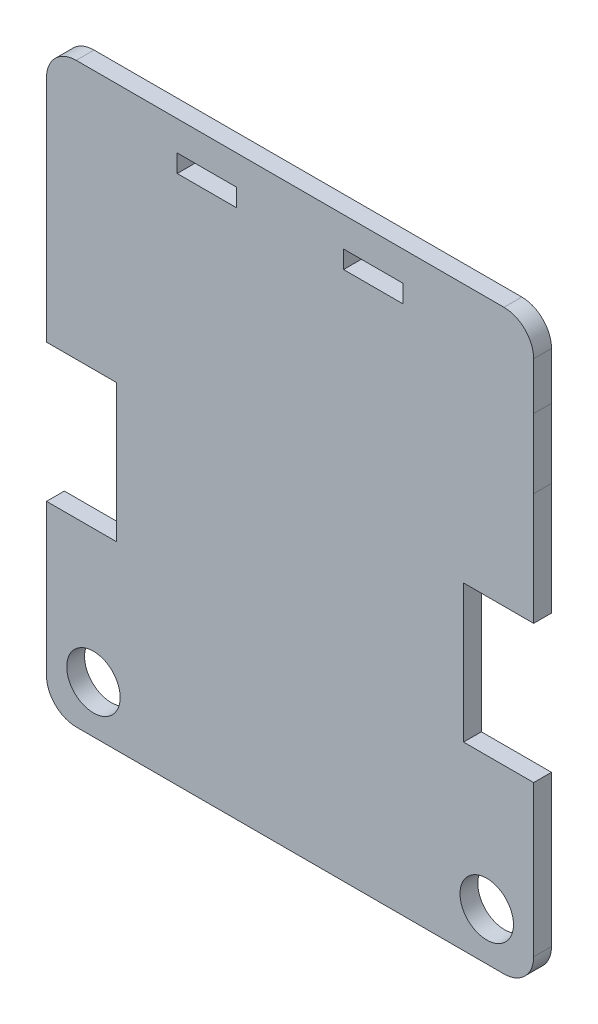
ISO-10303-21;
HEADER;
FILE_DESCRIPTION(('STEP AP214'),'2;1');
FILE_NAME('part.step','',(''),(''),'','','');
FILE_SCHEMA(('AUTOMOTIVE_DESIGN { 1 0 10303 214 1 1 1 1 }'));
ENDSEC;
DATA;
#1=APPLICATION_CONTEXT('core data for automotive mechanical design processes');
#2=APPLICATION_PROTOCOL_DEFINITION('international standard','automotive_design',2000,#1);
#3=PRODUCT_CONTEXT('',#1,'mechanical');
#4=PRODUCT('Part','Part','',(#3));
#5=PRODUCT_RELATED_PRODUCT_CATEGORY('part','',(#4));
#6=PRODUCT_DEFINITION_FORMATION('','',#4);
#7=PRODUCT_DEFINITION_CONTEXT('part definition',#1,'design');
#8=PRODUCT_DEFINITION('design','',#6,#7);
#9=PRODUCT_DEFINITION_SHAPE('','',#8);
#10=(LENGTH_UNIT() NAMED_UNIT(*) SI_UNIT(.MILLI.,.METRE.));
#11=(NAMED_UNIT(*) PLANE_ANGLE_UNIT() SI_UNIT($,.RADIAN.));
#12=(NAMED_UNIT(*) SI_UNIT($,.STERADIAN.) SOLID_ANGLE_UNIT());
#13=UNCERTAINTY_MEASURE_WITH_UNIT(LENGTH_MEASURE(1.E-05),#10,'distance_accuracy_value','');
#14=(GEOMETRIC_REPRESENTATION_CONTEXT(3) GLOBAL_UNCERTAINTY_ASSIGNED_CONTEXT((#13)) GLOBAL_UNIT_ASSIGNED_CONTEXT((#10,
#11,#12)) REPRESENTATION_CONTEXT('',''));
#15=CARTESIAN_POINT('',(0.,0.,0.));
#16=DIRECTION('',(0.,0.,1.));
#17=DIRECTION('',(1.,0.,0.));
#18=AXIS2_PLACEMENT_3D('',#15,#16,#17);
#19=CARTESIAN_POINT('',(72.203528383449,48.6883427131033,3.));
#20=DIRECTION('',(0.,0.,1.));
#21=DIRECTION('',(1.,0.,0.));
#22=AXIS2_PLACEMENT_3D('',#19,#20,#21);
#23=PLANE('',#22);
#24=CARTESIAN_POINT('',(69.303528383449,-35.4954464401244,3.));
#25=DIRECTION('',(0.,0.,1.));
#26=DIRECTION('',(1.,0.,0.));
#27=AXIS2_PLACEMENT_3D('',#24,#25,#26);
#28=CIRCLE('',#27,4.5);
#29=CARTESIAN_POINT('',(73.8035283834491,-35.4954464401244,3.));
#30=VERTEX_POINT('',#29);
#31=EDGE_CURVE('E278',#30,#30,#28,.T.);
#32=ORIENTED_EDGE('',*,*,#31,.F.);
#33=EDGE_LOOP('',(#32));
#34=FACE_BOUND('',#33,.T.);
#35=CARTESIAN_POINT('',(72.203528383449,48.6883427131033,3.));
#36=DIRECTION('',(0.,0.,1.));
#37=DIRECTION('',(1.,0.,0.));
#38=AXIS2_PLACEMENT_3D('',#35,#36,#37);
#39=CIRCLE('',#38,5.);
#40=CARTESIAN_POINT('',(77.203528383449,48.6883427131033,3.));
#41=VERTEX_POINT('',#40);
#42=CARTESIAN_POINT('',(72.203528383449,53.6883427131033,3.));
#43=VERTEX_POINT('',#42);
#44=EDGE_CURVE('E284',#41,#43,#39,.T.);
#45=ORIENTED_EDGE('',*,*,#44,.T.);
#46=DIRECTION('',(-1.,0.,0.));
#47=VECTOR('',#46,1.);
#48=CARTESIAN_POINT('',(62.6864958786092,53.6883427131033,3.));
#49=LINE('',#48,#47);
#50=CARTESIAN_POINT('',(0.206594728342232,53.6883427131033,3.));
#51=VERTEX_POINT('',#50);
#52=EDGE_CURVE('E287',#43,#51,#49,.T.);
#53=ORIENTED_EDGE('',*,*,#52,.T.);
#54=CARTESIAN_POINT('',(0.206594728342236,48.6883427131033,3.));
#55=DIRECTION('',(0.,0.,1.));
#56=DIRECTION('',(1.,0.,0.));
#57=AXIS2_PLACEMENT_3D('',#54,#55,#56);
#58=CIRCLE('',#57,5.);
#59=CARTESIAN_POINT('',(-4.79340527165777,48.6883427131033,3.));
#60=VERTEX_POINT('',#59);
#61=EDGE_CURVE('E290',#51,#60,#58,.T.);
#62=ORIENTED_EDGE('',*,*,#61,.T.);
#63=DIRECTION('',(0.,-1.,0.));
#64=VECTOR('',#63,1.);
#65=CARTESIAN_POINT('',(-4.79340527165777,48.6883427131033,3.));
#66=LINE('',#65,#64);
#67=CARTESIAN_POINT('',(-4.79340527165777,10.1045535598754,3.));
#68=VERTEX_POINT('',#67);
#69=EDGE_CURVE('E292',#60,#68,#66,.T.);
#70=ORIENTED_EDGE('',*,*,#69,.T.);
#71=DIRECTION('',(1.,0.,0.));
#72=VECTOR('',#71,1.);
#73=CARTESIAN_POINT('',(7.00659472834224,10.1045535598754,3.));
#74=LINE('',#73,#72);
#75=CARTESIAN_POINT('',(7.00659472834224,10.1045535598754,3.));
#76=VERTEX_POINT('',#75);
#77=EDGE_CURVE('E294',#68,#76,#74,.T.);
#78=ORIENTED_EDGE('',*,*,#77,.T.);
#79=DIRECTION('',(0.,-1.,0.));
#80=VECTOR('',#79,1.);
#81=CARTESIAN_POINT('',(7.00659472834224,-13.0954464401246,3.));
#82=LINE('',#81,#80);
#83=CARTESIAN_POINT('',(7.00659472834224,-13.0954464401246,3.));
#84=VERTEX_POINT('',#83);
#85=EDGE_CURVE('E296',#76,#84,#82,.T.);
#86=ORIENTED_EDGE('',*,*,#85,.T.);
#87=DIRECTION('',(-1.,0.,0.));
#88=VECTOR('',#87,1.);
#89=CARTESIAN_POINT('',(-4.79340527165777,-13.0954464401245,3.));
#90=LINE('',#89,#88);
#91=CARTESIAN_POINT('',(-4.79340527165777,-13.0954464401245,3.));
#92=VERTEX_POINT('',#91);
#93=EDGE_CURVE('E298',#84,#92,#90,.T.);
#94=ORIENTED_EDGE('',*,*,#93,.T.);
#95=DIRECTION('',(0.,-1.,0.));
#96=VECTOR('',#95,1.);
#97=CARTESIAN_POINT('',(-4.79340527165777,-13.0954464401245,3.));
#98=LINE('',#97,#96);
#99=CARTESIAN_POINT('',(-4.79340527165777,-38.4954460525135,3.));
#100=VERTEX_POINT('',#99);
#101=EDGE_CURVE('E300',#92,#100,#98,.T.);
#102=ORIENTED_EDGE('',*,*,#101,.T.);
#103=CARTESIAN_POINT('',(0.206594728342231,-38.4954460525135,3.));
#104=DIRECTION('',(0.,0.,1.));
#105=DIRECTION('',(1.,0.,0.));
#106=AXIS2_PLACEMENT_3D('',#103,#104,#105);
#107=CIRCLE('',#106,5.);
#108=CARTESIAN_POINT('',(0.206594728342232,-43.4954460525135,3.));
#109=VERTEX_POINT('',#108);
#110=EDGE_CURVE('E302',#100,#109,#107,.T.);
#111=ORIENTED_EDGE('',*,*,#110,.T.);
#112=DIRECTION('',(1.,0.,0.));
#113=VECTOR('',#112,1.);
#114=CARTESIAN_POINT('',(0.206594728342232,-43.4954460525135,3.));
#115=LINE('',#114,#113);
#116=CARTESIAN_POINT('',(72.203528383449,-43.4954460525135,3.));
#117=VERTEX_POINT('',#116);
#118=EDGE_CURVE('E304',#109,#117,#115,.T.);
#119=ORIENTED_EDGE('',*,*,#118,.T.);
#120=CARTESIAN_POINT('',(72.2035283834491,-38.4954460525136,3.));
#121=DIRECTION('',(0.,0.,1.));
#122=DIRECTION('',(1.,0.,0.));
#123=AXIS2_PLACEMENT_3D('',#120,#121,#122);
#124=CIRCLE('',#123,4.99999999999994);
#125=CARTESIAN_POINT('',(77.203528383449,-38.4954464401244,3.));
#126=VERTEX_POINT('',#125);
#127=EDGE_CURVE('E306',#117,#126,#124,.T.);
#128=ORIENTED_EDGE('',*,*,#127,.T.);
#129=DIRECTION('',(0.,1.,0.));
#130=VECTOR('',#129,1.);
#131=CARTESIAN_POINT('',(77.203528383449,-38.4954464401244,3.));
#132=LINE('',#131,#130);
#133=CARTESIAN_POINT('',(77.203528383449,-13.0954464401246,3.));
#134=VERTEX_POINT('',#133);
#135=EDGE_CURVE('E308',#126,#134,#132,.T.);
#136=ORIENTED_EDGE('',*,*,#135,.T.);
#137=DIRECTION('',(-1.,0.,0.));
#138=VECTOR('',#137,1.);
#139=CARTESIAN_POINT('',(65.403528383449,-13.0954464401246,3.));
#140=LINE('',#139,#138);
#141=CARTESIAN_POINT('',(65.403528383449,-13.0954464401246,3.));
#142=VERTEX_POINT('',#141);
#143=EDGE_CURVE('E310',#134,#142,#140,.T.);
#144=ORIENTED_EDGE('',*,*,#143,.T.);
#145=DIRECTION('',(0.,1.,0.));
#146=VECTOR('',#145,1.);
#147=CARTESIAN_POINT('',(65.403528383449,10.1045535598754,3.));
#148=LINE('',#147,#146);
#149=CARTESIAN_POINT('',(65.403528383449,10.1045535598754,3.));
#150=VERTEX_POINT('',#149);
#151=EDGE_CURVE('E312',#142,#150,#148,.T.);
#152=ORIENTED_EDGE('',*,*,#151,.T.);
#153=DIRECTION('',(1.,0.,0.));
#154=VECTOR('',#153,1.);
#155=CARTESIAN_POINT('',(77.203528383449,10.1045535598754,3.));
#156=LINE('',#155,#154);
#157=CARTESIAN_POINT('',(77.203528383449,10.1045535598754,3.));
#158=VERTEX_POINT('',#157);
#159=EDGE_CURVE('E314',#150,#158,#156,.T.);
#160=ORIENTED_EDGE('',*,*,#159,.T.);
#161=DIRECTION('',(1.78942856260876E-12,1.,0.));
#162=VECTOR('',#161,1.);
#163=CARTESIAN_POINT('',(77.2035283834659,19.5506671981172,3.));
#164=LINE('',#163,#162);
#165=CARTESIAN_POINT('',(77.2035283834688,29.0099072291552,3.));
#166=VERTEX_POINT('',#165);
#167=EDGE_CURVE('E316',#158,#166,#164,.T.);
#168=ORIENTED_EDGE('',*,*,#167,.T.);
#169=DIRECTION('',(-0.000262564691243495,0.999999965529891,0.));
#170=VECTOR('',#169,1.);
#171=CARTESIAN_POINT('',(77.2035283834688,29.0099072291552,3.));
#172=LINE('',#171,#170);
#173=CARTESIAN_POINT('',(77.2004620385561,40.6883427131033,3.));
#174=VERTEX_POINT('',#173);
#175=EDGE_CURVE('E318',#166,#174,#172,.T.);
#176=ORIENTED_EDGE('',*,*,#175,.T.);
#177=DIRECTION('',(0.00038329308345552,0.999999926543203,0.));
#178=VECTOR('',#177,1.);
#179=CARTESIAN_POINT('',(77.2004620385561,40.6883427131033,3.));
#180=LINE('',#179,#178);
#181=EDGE_CURVE('E320',#174,#41,#180,.T.);
#182=ORIENTED_EDGE('',*,*,#181,.T.);
#183=EDGE_LOOP('',(#45,#53,#62,#70,#78,#86,#94,#102,#111,#119,#128,#136,#144,#152,#160,#168,
#176,#182));
#184=FACE_BOUND('',#183,.T.);
#185=CARTESIAN_POINT('',(3.10352838345015,-35.4954464401244,3.));
#186=DIRECTION('',(0.,0.,1.));
#187=DIRECTION('',(1.,0.,0.));
#188=AXIS2_PLACEMENT_3D('',#185,#186,#187);
#189=CIRCLE('',#188,4.5);
#190=CARTESIAN_POINT('',(7.60352838345015,-35.4954464401244,3.));
#191=VERTEX_POINT('',#190);
#192=EDGE_CURVE('E272',#191,#191,#189,.T.);
#193=ORIENTED_EDGE('',*,*,#192,.F.);
#194=EDGE_LOOP('',(#193));
#195=FACE_BOUND('',#194,.T.);
#196=DIRECTION('',(0.,-1.,0.));
#197=VECTOR('',#196,1.);
#198=CARTESIAN_POINT('',(17.2035283834491,48.6883427131033,3.));
#199=LINE('',#198,#197);
#200=CARTESIAN_POINT('',(17.2035283834491,48.6883427131033,3.));
#201=VERTEX_POINT('',#200);
#202=CARTESIAN_POINT('',(17.2035283834491,45.6883427131033,3.));
#203=VERTEX_POINT('',#202);
#204=EDGE_CURVE('E243',#201,#203,#199,.T.);
#205=ORIENTED_EDGE('',*,*,#204,.F.);
#206=DIRECTION('',(-1.,0.,0.));
#207=VECTOR('',#206,1.);
#208=CARTESIAN_POINT('',(27.2035283834491,48.6883427131033,3.));
#209=LINE('',#208,#207);
#210=CARTESIAN_POINT('',(27.2035283834491,48.6883427131033,3.));
#211=VERTEX_POINT('',#210);
#212=EDGE_CURVE('E241',#211,#201,#209,.T.);
#213=ORIENTED_EDGE('',*,*,#212,.F.);
#214=DIRECTION('',(0.,1.,0.));
#215=VECTOR('',#214,1.);
#216=CARTESIAN_POINT('',(27.2035283834491,45.6883427131033,3.));
#217=LINE('',#216,#215);
#218=CARTESIAN_POINT('',(27.2035283834491,45.6883427131033,3.));
#219=VERTEX_POINT('',#218);
#220=EDGE_CURVE('E249',#219,#211,#217,.T.);
#221=ORIENTED_EDGE('',*,*,#220,.F.);
#222=DIRECTION('',(1.,0.,0.));
#223=VECTOR('',#222,1.);
#224=CARTESIAN_POINT('',(17.2035283834491,45.6883427131033,3.));
#225=LINE('',#224,#223);
#226=EDGE_CURVE('E246',#203,#219,#225,.T.);
#227=ORIENTED_EDGE('',*,*,#226,.F.);
#228=EDGE_LOOP('',(#205,#213,#221,#227));
#229=FACE_BOUND('',#228,.T.);
#230=DIRECTION('',(-1.,0.,0.));
#231=VECTOR('',#230,1.);
#232=CARTESIAN_POINT('',(55.2035283834492,48.6883427131033,3.));
#233=LINE('',#232,#231);
#234=CARTESIAN_POINT('',(55.2035283834492,48.6883427131033,3.));
#235=VERTEX_POINT('',#234);
#236=CARTESIAN_POINT('',(45.2035283834492,48.6883427131033,3.));
#237=VERTEX_POINT('',#236);
#238=EDGE_CURVE('E213',#235,#237,#233,.T.);
#239=ORIENTED_EDGE('',*,*,#238,.F.);
#240=DIRECTION('',(0.,1.,0.));
#241=VECTOR('',#240,1.);
#242=CARTESIAN_POINT('',(55.2035283834492,45.6883427131033,3.));
#243=LINE('',#242,#241);
#244=CARTESIAN_POINT('',(55.2035283834492,45.6883427131033,3.));
#245=VERTEX_POINT('',#244);
#246=EDGE_CURVE('E205',#245,#235,#243,.T.);
#247=ORIENTED_EDGE('',*,*,#246,.F.);
#248=DIRECTION('',(1.,0.,0.));
#249=VECTOR('',#248,1.);
#250=CARTESIAN_POINT('',(45.2035283834492,45.6883427131033,3.));
#251=LINE('',#250,#249);
#252=CARTESIAN_POINT('',(45.2035283834492,45.6883427131033,3.));
#253=VERTEX_POINT('',#252);
#254=EDGE_CURVE('E227',#253,#245,#251,.T.);
#255=ORIENTED_EDGE('',*,*,#254,.F.);
#256=DIRECTION('',(0.,-1.,0.));
#257=VECTOR('',#256,1.);
#258=CARTESIAN_POINT('',(45.2035283834492,48.6883427131033,3.));
#259=LINE('',#258,#257);
#260=EDGE_CURVE('E225',#237,#253,#259,.T.);
#261=ORIENTED_EDGE('',*,*,#260,.F.);
#262=EDGE_LOOP('',(#239,#247,#255,#261));
#263=FACE_BOUND('',#262,.T.);
#264=ADVANCED_FACE('F32',(#34,#184,#195,#229,#263),#23,.T.);
#265=CARTESIAN_POINT('',(72.203528383449,48.6883427131033,0.));
#266=DIRECTION('',(0.,0.,1.));
#267=DIRECTION('',(1.,0.,0.));
#268=AXIS2_PLACEMENT_3D('',#265,#266,#267);
#269=PLANE('',#268);
#270=DIRECTION('',(-1.,0.,0.));
#271=VECTOR('',#270,1.);
#272=CARTESIAN_POINT('',(27.2035283834491,48.6883427131033,0.));
#273=LINE('',#272,#271);
#274=CARTESIAN_POINT('',(27.2035283834491,48.6883427131033,0.));
#275=VERTEX_POINT('',#274);
#276=CARTESIAN_POINT('',(17.2035283834491,48.6883427131033,0.));
#277=VERTEX_POINT('',#276);
#278=EDGE_CURVE('E221',#275,#277,#273,.T.);
#279=ORIENTED_EDGE('',*,*,#278,.T.);
#280=DIRECTION('',(0.,-1.,0.));
#281=VECTOR('',#280,1.);
#282=CARTESIAN_POINT('',(17.2035283834491,48.6883427131033,0.));
#283=LINE('',#282,#281);
#284=CARTESIAN_POINT('',(17.2035283834491,45.6883427131033,0.));
#285=VERTEX_POINT('',#284);
#286=EDGE_CURVE('E254',#277,#285,#283,.T.);
#287=ORIENTED_EDGE('',*,*,#286,.T.);
#288=DIRECTION('',(1.,0.,0.));
#289=VECTOR('',#288,1.);
#290=CARTESIAN_POINT('',(17.2035283834491,45.6883427131033,0.));
#291=LINE('',#290,#289);
#292=CARTESIAN_POINT('',(27.2035283834491,45.6883427131033,0.));
#293=VERTEX_POINT('',#292);
#294=EDGE_CURVE('E257',#285,#293,#291,.T.);
#295=ORIENTED_EDGE('',*,*,#294,.T.);
#296=DIRECTION('',(0.,1.,0.));
#297=VECTOR('',#296,1.);
#298=CARTESIAN_POINT('',(27.2035283834491,45.6883427131033,0.));
#299=LINE('',#298,#297);
#300=EDGE_CURVE('E244',#293,#275,#299,.T.);
#301=ORIENTED_EDGE('',*,*,#300,.T.);
#302=EDGE_LOOP('',(#279,#287,#295,#301));
#303=FACE_BOUND('',#302,.T.);
#304=CARTESIAN_POINT('',(72.203528383449,48.6883427131033,0.));
#305=DIRECTION('',(0.,0.,1.));
#306=DIRECTION('',(1.,0.,0.));
#307=AXIS2_PLACEMENT_3D('',#304,#305,#306);
#308=CIRCLE('',#307,5.);
#309=CARTESIAN_POINT('',(77.203528383449,48.6883427131033,0.));
#310=VERTEX_POINT('',#309);
#311=CARTESIAN_POINT('',(72.203528383449,53.6883427131033,0.));
#312=VERTEX_POINT('',#311);
#313=EDGE_CURVE('E281',#310,#312,#308,.T.);
#314=ORIENTED_EDGE('',*,*,#313,.F.);
#315=DIRECTION('',(0.00038329308345552,0.999999926543203,0.));
#316=VECTOR('',#315,1.);
#317=CARTESIAN_POINT('',(77.2004620385561,40.6883427131033,0.));
#318=LINE('',#317,#316);
#319=CARTESIAN_POINT('',(77.2004620385561,40.6883427131033,0.));
#320=VERTEX_POINT('',#319);
#321=EDGE_CURVE('E288',#320,#310,#318,.T.);
#322=ORIENTED_EDGE('',*,*,#321,.F.);
#323=DIRECTION('',(-0.000262564691243495,0.999999965529891,0.));
#324=VECTOR('',#323,1.);
#325=CARTESIAN_POINT('',(77.2035283834688,29.0099072291552,0.));
#326=LINE('',#325,#324);
#327=CARTESIAN_POINT('',(77.2035283834688,29.0099072291552,0.));
#328=VERTEX_POINT('',#327);
#329=EDGE_CURVE('E358',#328,#320,#326,.T.);
#330=ORIENTED_EDGE('',*,*,#329,.F.);
#331=DIRECTION('',(3.12495379477131E-13,1.,0.));
#332=VECTOR('',#331,1.);
#333=CARTESIAN_POINT('',(77.2035283834688,29.0099072291552,0.));
#334=LINE('',#333,#332);
#335=CARTESIAN_POINT('',(77.203528383449,10.1045535598754,0.));
#336=VERTEX_POINT('',#335);
#337=EDGE_CURVE('E356',#336,#328,#334,.T.);
#338=ORIENTED_EDGE('',*,*,#337,.F.);
#339=DIRECTION('',(1.,0.,0.));
#340=VECTOR('',#339,1.);
#341=CARTESIAN_POINT('',(77.203528383449,10.1045535598754,0.));
#342=LINE('',#341,#340);
#343=CARTESIAN_POINT('',(65.403528383449,10.1045535598754,0.));
#344=VERTEX_POINT('',#343);
#345=EDGE_CURVE('E353',#344,#336,#342,.T.);
#346=ORIENTED_EDGE('',*,*,#345,.F.);
#347=DIRECTION('',(0.,1.,0.));
#348=VECTOR('',#347,1.);
#349=CARTESIAN_POINT('',(65.403528383449,10.1045535598754,0.));
#350=LINE('',#349,#348);
#351=CARTESIAN_POINT('',(65.403528383449,-13.0954464401246,0.));
#352=VERTEX_POINT('',#351);
#353=EDGE_CURVE('E351',#352,#344,#350,.T.);
#354=ORIENTED_EDGE('',*,*,#353,.F.);
#355=DIRECTION('',(-1.,0.,0.));
#356=VECTOR('',#355,1.);
#357=CARTESIAN_POINT('',(65.403528383449,-13.0954464401246,0.));
#358=LINE('',#357,#356);
#359=CARTESIAN_POINT('',(77.203528383449,-13.0954464401246,0.));
#360=VERTEX_POINT('',#359);
#361=EDGE_CURVE('E349',#360,#352,#358,.T.);
#362=ORIENTED_EDGE('',*,*,#361,.F.);
#363=DIRECTION('',(0.,1.,0.));
#364=VECTOR('',#363,1.);
#365=CARTESIAN_POINT('',(77.203528383449,-33.1904365899432,0.));
#366=LINE('',#365,#364);
#367=CARTESIAN_POINT('',(77.203528383449,-38.4954464401244,0.));
#368=VERTEX_POINT('',#367);
#369=EDGE_CURVE('E347',#368,#360,#366,.T.);
#370=ORIENTED_EDGE('',*,*,#369,.F.);
#371=CARTESIAN_POINT('',(72.2035283834491,-38.4954460525136,0.));
#372=DIRECTION('',(0.,0.,1.));
#373=DIRECTION('',(1.,0.,0.));
#374=AXIS2_PLACEMENT_3D('',#371,#372,#373);
#375=CIRCLE('',#374,4.99999999999994);
#376=CARTESIAN_POINT('',(72.203528383449,-43.4954460525135,0.));
#377=VERTEX_POINT('',#376);
#378=EDGE_CURVE('E344',#377,#368,#375,.T.);
#379=ORIENTED_EDGE('',*,*,#378,.F.);
#380=DIRECTION('',(1.,0.,0.));
#381=VECTOR('',#380,1.);
#382=CARTESIAN_POINT('',(0.206594728342232,-43.4954460525135,0.));
#383=LINE('',#382,#381);
#384=CARTESIAN_POINT('',(0.206594728342232,-43.4954460525135,0.));
#385=VERTEX_POINT('',#384);
#386=EDGE_CURVE('E342',#385,#377,#383,.T.);
#387=ORIENTED_EDGE('',*,*,#386,.F.);
#388=CARTESIAN_POINT('',(0.206594728342231,-38.4954460525135,0.));
#389=DIRECTION('',(0.,0.,1.));
#390=DIRECTION('',(1.,0.,0.));
#391=AXIS2_PLACEMENT_3D('',#388,#389,#390);
#392=CIRCLE('',#391,5.);
#393=CARTESIAN_POINT('',(-4.79340527165777,-38.4954460525135,0.));
#394=VERTEX_POINT('',#393);
#395=EDGE_CURVE('E340',#394,#385,#392,.T.);
#396=ORIENTED_EDGE('',*,*,#395,.F.);
#397=DIRECTION('',(0.,-1.,0.));
#398=VECTOR('',#397,1.);
#399=CARTESIAN_POINT('',(-4.79340527165777,-13.0954464401245,0.));
#400=LINE('',#399,#398);
#401=CARTESIAN_POINT('',(-4.79340527165777,-13.0954464401245,0.));
#402=VERTEX_POINT('',#401);
#403=EDGE_CURVE('E338',#402,#394,#400,.T.);
#404=ORIENTED_EDGE('',*,*,#403,.F.);
#405=DIRECTION('',(-1.,0.,0.));
#406=VECTOR('',#405,1.);
#407=CARTESIAN_POINT('',(-4.79340527165777,-13.0954464401245,0.));
#408=LINE('',#407,#406);
#409=CARTESIAN_POINT('',(7.00659472834224,-13.0954464401246,0.));
#410=VERTEX_POINT('',#409);
#411=EDGE_CURVE('E336',#410,#402,#408,.T.);
#412=ORIENTED_EDGE('',*,*,#411,.F.);
#413=DIRECTION('',(0.,-1.,0.));
#414=VECTOR('',#413,1.);
#415=CARTESIAN_POINT('',(7.00659472834224,-13.0954464401246,0.));
#416=LINE('',#415,#414);
#417=CARTESIAN_POINT('',(7.00659472834224,10.1045535598754,0.));
#418=VERTEX_POINT('',#417);
#419=EDGE_CURVE('E334',#418,#410,#416,.T.);
#420=ORIENTED_EDGE('',*,*,#419,.F.);
#421=DIRECTION('',(1.,0.,0.));
#422=VECTOR('',#421,1.);
#423=CARTESIAN_POINT('',(7.00659472834224,10.1045535598754,0.));
#424=LINE('',#423,#422);
#425=CARTESIAN_POINT('',(-4.79340527165777,10.1045535598754,0.));
#426=VERTEX_POINT('',#425);
#427=EDGE_CURVE('E332',#426,#418,#424,.T.);
#428=ORIENTED_EDGE('',*,*,#427,.F.);
#429=DIRECTION('',(0.,-1.,0.));
#430=VECTOR('',#429,1.);
#431=CARTESIAN_POINT('',(-4.79340527165777,40.6883427131033,0.));
#432=LINE('',#431,#430);
#433=CARTESIAN_POINT('',(-4.79340527165777,48.6883427131033,0.));
#434=VERTEX_POINT('',#433);
#435=EDGE_CURVE('E330',#434,#426,#432,.T.);
#436=ORIENTED_EDGE('',*,*,#435,.F.);
#437=CARTESIAN_POINT('',(0.206594728342236,48.6883427131033,0.));
#438=DIRECTION('',(0.,0.,1.));
#439=DIRECTION('',(1.,0.,0.));
#440=AXIS2_PLACEMENT_3D('',#437,#438,#439);
#441=CIRCLE('',#440,5.);
#442=CARTESIAN_POINT('',(0.206594728342232,53.6883427131033,0.));
#443=VERTEX_POINT('',#442);
#444=EDGE_CURVE('E327',#443,#434,#441,.T.);
#445=ORIENTED_EDGE('',*,*,#444,.F.);
#446=DIRECTION('',(-1.,0.,0.));
#447=VECTOR('',#446,1.);
#448=CARTESIAN_POINT('',(6.68151859722884,53.6883427131033,0.));
#449=LINE('',#448,#447);
#450=EDGE_CURVE('E325',#312,#443,#449,.T.);
#451=ORIENTED_EDGE('',*,*,#450,.F.);
#452=EDGE_LOOP('',(#314,#322,#330,#338,#346,#354,#362,#370,#379,#387,#396,#404,#412,#420,#428,
#436,#445,#451));
#453=FACE_BOUND('',#452,.T.);
#454=CARTESIAN_POINT('',(69.303528383449,-35.4954464401244,0.));
#455=DIRECTION('',(0.,0.,1.));
#456=DIRECTION('',(1.,0.,0.));
#457=AXIS2_PLACEMENT_3D('',#454,#455,#456);
#458=CIRCLE('',#457,4.5);
#459=CARTESIAN_POINT('',(73.8035283834491,-35.4954464401244,0.));
#460=VERTEX_POINT('',#459);
#461=EDGE_CURVE('E275',#460,#460,#458,.T.);
#462=ORIENTED_EDGE('',*,*,#461,.T.);
#463=EDGE_LOOP('',(#462));
#464=FACE_BOUND('',#463,.T.);
#465=CARTESIAN_POINT('',(3.10352838345015,-35.4954464401244,0.));
#466=DIRECTION('',(0.,0.,1.));
#467=DIRECTION('',(1.,0.,0.));
#468=AXIS2_PLACEMENT_3D('',#465,#466,#467);
#469=CIRCLE('',#468,4.5);
#470=CARTESIAN_POINT('',(7.60352838345015,-35.4954464401244,0.));
#471=VERTEX_POINT('',#470);
#472=EDGE_CURVE('E271',#471,#471,#469,.T.);
#473=ORIENTED_EDGE('',*,*,#472,.T.);
#474=EDGE_LOOP('',(#473));
#475=FACE_BOUND('',#474,.T.);
#476=DIRECTION('',(0.,1.,0.));
#477=VECTOR('',#476,1.);
#478=CARTESIAN_POINT('',(55.2035283834492,45.6883427131033,0.));
#479=LINE('',#478,#477);
#480=CARTESIAN_POINT('',(55.2035283834492,45.6883427131033,0.));
#481=VERTEX_POINT('',#480);
#482=CARTESIAN_POINT('',(55.2035283834492,48.6883427131033,0.));
#483=VERTEX_POINT('',#482);
#484=EDGE_CURVE('E55',#481,#483,#479,.T.);
#485=ORIENTED_EDGE('',*,*,#484,.T.);
#486=DIRECTION('',(-1.,0.,0.));
#487=VECTOR('',#486,1.);
#488=CARTESIAN_POINT('',(55.2035283834492,48.6883427131033,0.));
#489=LINE('',#488,#487);
#490=CARTESIAN_POINT('',(45.2035283834492,48.6883427131033,0.));
#491=VERTEX_POINT('',#490);
#492=EDGE_CURVE('E220',#483,#491,#489,.T.);
#493=ORIENTED_EDGE('',*,*,#492,.T.);
#494=DIRECTION('',(0.,-1.,0.));
#495=VECTOR('',#494,1.);
#496=CARTESIAN_POINT('',(45.2035283834492,48.6883427131033,0.));
#497=LINE('',#496,#495);
#498=CARTESIAN_POINT('',(45.2035283834492,45.6883427131033,0.));
#499=VERTEX_POINT('',#498);
#500=EDGE_CURVE('E233',#491,#499,#497,.T.);
#501=ORIENTED_EDGE('',*,*,#500,.T.);
#502=DIRECTION('',(1.,0.,0.));
#503=VECTOR('',#502,1.);
#504=CARTESIAN_POINT('',(45.2035283834492,45.6883427131033,0.));
#505=LINE('',#504,#503);
#506=EDGE_CURVE('E214',#499,#481,#505,.T.);
#507=ORIENTED_EDGE('',*,*,#506,.T.);
#508=EDGE_LOOP('',(#485,#493,#501,#507));
#509=FACE_BOUND('',#508,.T.);
#510=ADVANCED_FACE('F417',(#303,#453,#464,#475,#509),#269,.F.);
#511=CARTESIAN_POINT('',(72.203528383449,48.6883427131033,3.));
#512=DIRECTION('',(0.,0.,-1.));
#513=DIRECTION('',(-1.,0.,0.));
#514=AXIS2_PLACEMENT_3D('',#511,#512,#513);
#515=CYLINDRICAL_SURFACE('',#514,5.);
#516=ORIENTED_EDGE('',*,*,#313,.T.);
#517=DIRECTION('',(0.,0.,-1.));
#518=VECTOR('',#517,1.);
#519=CARTESIAN_POINT('',(72.203528383449,53.6883427131033,3.));
#520=LINE('',#519,#518);
#521=EDGE_CURVE('E11',#43,#312,#520,.T.);
#522=ORIENTED_EDGE('',*,*,#521,.F.);
#523=ORIENTED_EDGE('',*,*,#44,.F.);
#524=DIRECTION('',(0.,0.,-1.));
#525=VECTOR('',#524,1.);
#526=CARTESIAN_POINT('',(77.203528383449,48.6883427131033,3.));
#527=LINE('',#526,#525);
#528=EDGE_CURVE('E322',#41,#310,#527,.T.);
#529=ORIENTED_EDGE('',*,*,#528,.T.);
#530=EDGE_LOOP('',(#516,#522,#523,#529));
#531=FACE_BOUND('',#530,.T.);
#532=ADVANCED_FACE('F34',(#531),#515,.T.);
#533=CARTESIAN_POINT('',(6.68151859722884,53.6883427131033,3.));
#534=DIRECTION('',(0.,-1.,0.));
#535=DIRECTION('',(1.,0.,0.));
#536=AXIS2_PLACEMENT_3D('',#533,#534,#535);
#537=PLANE('',#536);
#538=ORIENTED_EDGE('',*,*,#450,.T.);
#539=DIRECTION('',(0.,0.,-1.));
#540=VECTOR('',#539,1.);
#541=CARTESIAN_POINT('',(0.206594728342232,53.6883427131033,3.));
#542=LINE('',#541,#540);
#543=EDGE_CURVE('E40',#51,#443,#542,.T.);
#544=ORIENTED_EDGE('',*,*,#543,.F.);
#545=ORIENTED_EDGE('',*,*,#52,.F.);
#546=ORIENTED_EDGE('',*,*,#521,.T.);
#547=EDGE_LOOP('',(#538,#544,#545,#546));
#548=FACE_BOUND('',#547,.T.);
#549=ADVANCED_FACE('F435',(#548),#537,.F.);
#550=CARTESIAN_POINT('',(0.206594728342236,48.6883427131033,3.));
#551=DIRECTION('',(0.,0.,-1.));
#552=DIRECTION('',(-1.,0.,0.));
#553=AXIS2_PLACEMENT_3D('',#550,#551,#552);
#554=CYLINDRICAL_SURFACE('',#553,5.);
#555=ORIENTED_EDGE('',*,*,#444,.T.);
#556=DIRECTION('',(0.,0.,-1.));
#557=VECTOR('',#556,1.);
#558=CARTESIAN_POINT('',(-4.79340527165777,48.6883427131033,3.));
#559=LINE('',#558,#557);
#560=EDGE_CURVE('E405',#60,#434,#559,.T.);
#561=ORIENTED_EDGE('',*,*,#560,.F.);
#562=ORIENTED_EDGE('',*,*,#61,.F.);
#563=ORIENTED_EDGE('',*,*,#543,.T.);
#564=EDGE_LOOP('',(#555,#561,#562,#563));
#565=FACE_BOUND('',#564,.T.);
#566=ADVANCED_FACE('F412',(#565),#554,.T.);
#567=CARTESIAN_POINT('',(-4.79340527165777,40.6883427131033,3.));
#568=DIRECTION('',(1.,0.,0.));
#569=DIRECTION('',(0.,0.,-1.));
#570=AXIS2_PLACEMENT_3D('',#567,#568,#569);
#571=PLANE('',#570);
#572=ORIENTED_EDGE('',*,*,#435,.T.);
#573=DIRECTION('',(0.,0.,-1.));
#574=VECTOR('',#573,1.);
#575=CARTESIAN_POINT('',(-4.79340527165777,10.1045535598754,3.));
#576=LINE('',#575,#574);
#577=EDGE_CURVE('E402',#68,#426,#576,.T.);
#578=ORIENTED_EDGE('',*,*,#577,.F.);
#579=ORIENTED_EDGE('',*,*,#69,.F.);
#580=ORIENTED_EDGE('',*,*,#560,.T.);
#581=EDGE_LOOP('',(#572,#578,#579,#580));
#582=FACE_BOUND('',#581,.T.);
#583=ADVANCED_FACE('F423',(#582),#571,.F.);
#584=CARTESIAN_POINT('',(7.00659472834224,10.1045535598754,3.));
#585=DIRECTION('',(0.,1.,0.));
#586=DIRECTION('',(0.,0.,1.));
#587=AXIS2_PLACEMENT_3D('',#584,#585,#586);
#588=PLANE('',#587);
#589=ORIENTED_EDGE('',*,*,#427,.T.);
#590=DIRECTION('',(0.,0.,-1.));
#591=VECTOR('',#590,1.);
#592=CARTESIAN_POINT('',(7.00659472834224,10.1045535598754,3.));
#593=LINE('',#592,#591);
#594=EDGE_CURVE('E399',#76,#418,#593,.T.);
#595=ORIENTED_EDGE('',*,*,#594,.F.);
#596=ORIENTED_EDGE('',*,*,#77,.F.);
#597=ORIENTED_EDGE('',*,*,#577,.T.);
#598=EDGE_LOOP('',(#589,#595,#596,#597));
#599=FACE_BOUND('',#598,.T.);
#600=ADVANCED_FACE('F427',(#599),#588,.F.);
#601=CARTESIAN_POINT('',(7.00659472834224,-13.0954464401246,3.));
#602=DIRECTION('',(1.,0.,0.));
#603=DIRECTION('',(0.,0.,-1.));
#604=AXIS2_PLACEMENT_3D('',#601,#602,#603);
#605=PLANE('',#604);
#606=ORIENTED_EDGE('',*,*,#419,.T.);
#607=DIRECTION('',(0.,0.,-1.));
#608=VECTOR('',#607,1.);
#609=CARTESIAN_POINT('',(7.00659472834224,-13.0954464401246,3.));
#610=LINE('',#609,#608);
#611=EDGE_CURVE('E396',#84,#410,#610,.T.);
#612=ORIENTED_EDGE('',*,*,#611,.F.);
#613=ORIENTED_EDGE('',*,*,#85,.F.);
#614=ORIENTED_EDGE('',*,*,#594,.T.);
#615=EDGE_LOOP('',(#606,#612,#613,#614));
#616=FACE_BOUND('',#615,.T.);
#617=ADVANCED_FACE('F496',(#616),#605,.F.);
#618=CARTESIAN_POINT('',(-4.79340527165777,-13.0954464401245,3.));
#619=DIRECTION('',(0.,-1.,0.));
#620=DIRECTION('',(1.,0.,0.));
#621=AXIS2_PLACEMENT_3D('',#618,#619,#620);
#622=PLANE('',#621);
#623=ORIENTED_EDGE('',*,*,#411,.T.);
#624=DIRECTION('',(0.,0.,-1.));
#625=VECTOR('',#624,1.);
#626=CARTESIAN_POINT('',(-4.79340527165777,-13.0954464401245,3.));
#627=LINE('',#626,#625);
#628=EDGE_CURVE('E393',#92,#402,#627,.T.);
#629=ORIENTED_EDGE('',*,*,#628,.F.);
#630=ORIENTED_EDGE('',*,*,#93,.F.);
#631=ORIENTED_EDGE('',*,*,#611,.T.);
#632=EDGE_LOOP('',(#623,#629,#630,#631));
#633=FACE_BOUND('',#632,.T.);
#634=ADVANCED_FACE('F493',(#633),#622,.F.);
#635=CARTESIAN_POINT('',(-4.79340527165777,-13.0954464401245,3.));
#636=DIRECTION('',(1.,0.,0.));
#637=DIRECTION('',(0.,0.,-1.));
#638=AXIS2_PLACEMENT_3D('',#635,#636,#637);
#639=PLANE('',#638);
#640=ORIENTED_EDGE('',*,*,#403,.T.);
#641=DIRECTION('',(0.,0.,-1.));
#642=VECTOR('',#641,1.);
#643=CARTESIAN_POINT('',(-4.79340527165777,-38.4954460525135,3.));
#644=LINE('',#643,#642);
#645=EDGE_CURVE('E390',#100,#394,#644,.T.);
#646=ORIENTED_EDGE('',*,*,#645,.F.);
#647=ORIENTED_EDGE('',*,*,#101,.F.);
#648=ORIENTED_EDGE('',*,*,#628,.T.);
#649=EDGE_LOOP('',(#640,#646,#647,#648));
#650=FACE_BOUND('',#649,.T.);
#651=ADVANCED_FACE('F489',(#650),#639,.F.);
#652=CARTESIAN_POINT('',(0.206594728342231,-38.4954460525135,3.));
#653=DIRECTION('',(0.,0.,-1.));
#654=DIRECTION('',(-1.,0.,0.));
#655=AXIS2_PLACEMENT_3D('',#652,#653,#654);
#656=CYLINDRICAL_SURFACE('',#655,5.);
#657=ORIENTED_EDGE('',*,*,#395,.T.);
#658=DIRECTION('',(0.,0.,-1.));
#659=VECTOR('',#658,1.);
#660=CARTESIAN_POINT('',(0.206594728342232,-43.4954460525135,3.));
#661=LINE('',#660,#659);
#662=EDGE_CURVE('E387',#109,#385,#661,.T.);
#663=ORIENTED_EDGE('',*,*,#662,.F.);
#664=ORIENTED_EDGE('',*,*,#110,.F.);
#665=ORIENTED_EDGE('',*,*,#645,.T.);
#666=EDGE_LOOP('',(#657,#663,#664,#665));
#667=FACE_BOUND('',#666,.T.);
#668=ADVANCED_FACE('F485',(#667),#656,.T.);
#669=CARTESIAN_POINT('',(0.206594728342232,-43.4954460525135,3.));
#670=DIRECTION('',(0.,1.,0.));
#671=DIRECTION('',(0.,0.,1.));
#672=AXIS2_PLACEMENT_3D('',#669,#670,#671);
#673=PLANE('',#672);
#674=ORIENTED_EDGE('',*,*,#386,.T.);
#675=DIRECTION('',(0.,0.,-1.));
#676=VECTOR('',#675,1.);
#677=CARTESIAN_POINT('',(72.203528383449,-43.4954460525135,3.));
#678=LINE('',#677,#676);
#679=EDGE_CURVE('E384',#117,#377,#678,.T.);
#680=ORIENTED_EDGE('',*,*,#679,.F.);
#681=ORIENTED_EDGE('',*,*,#118,.F.);
#682=ORIENTED_EDGE('',*,*,#662,.T.);
#683=EDGE_LOOP('',(#674,#680,#681,#682));
#684=FACE_BOUND('',#683,.T.);
#685=ADVANCED_FACE('F480',(#684),#673,.F.);
#686=CARTESIAN_POINT('',(72.2035283834491,-38.4954460525136,3.));
#687=DIRECTION('',(0.,0.,-1.));
#688=DIRECTION('',(-1.,0.,0.));
#689=AXIS2_PLACEMENT_3D('',#686,#687,#688);
#690=CYLINDRICAL_SURFACE('',#689,4.99999999999994);
#691=ORIENTED_EDGE('',*,*,#378,.T.);
#692=DIRECTION('',(0.,0.,-1.));
#693=VECTOR('',#692,1.);
#694=CARTESIAN_POINT('',(77.203528383449,-38.4954464401244,3.));
#695=LINE('',#694,#693);
#696=EDGE_CURVE('E381',#126,#368,#695,.T.);
#697=ORIENTED_EDGE('',*,*,#696,.F.);
#698=ORIENTED_EDGE('',*,*,#127,.F.);
#699=ORIENTED_EDGE('',*,*,#679,.T.);
#700=EDGE_LOOP('',(#691,#697,#698,#699));
#701=FACE_BOUND('',#700,.T.);
#702=ADVANCED_FACE('F474',(#701),#690,.T.);
#703=CARTESIAN_POINT('',(77.203528383449,-33.1904365899432,3.));
#704=DIRECTION('',(-1.,0.,0.));
#705=DIRECTION('',(0.,0.,1.));
#706=AXIS2_PLACEMENT_3D('',#703,#704,#705);
#707=PLANE('',#706);
#708=ORIENTED_EDGE('',*,*,#369,.T.);
#709=DIRECTION('',(0.,0.,-1.));
#710=VECTOR('',#709,1.);
#711=CARTESIAN_POINT('',(77.203528383449,-13.0954464401246,3.));
#712=LINE('',#711,#710);
#713=EDGE_CURVE('E378',#134,#360,#712,.T.);
#714=ORIENTED_EDGE('',*,*,#713,.F.);
#715=ORIENTED_EDGE('',*,*,#135,.F.);
#716=ORIENTED_EDGE('',*,*,#696,.T.);
#717=EDGE_LOOP('',(#708,#714,#715,#716));
#718=FACE_BOUND('',#717,.T.);
#719=ADVANCED_FACE('F470',(#718),#707,.F.);
#720=CARTESIAN_POINT('',(65.403528383449,-13.0954464401246,3.));
#721=DIRECTION('',(0.,-1.,0.));
#722=DIRECTION('',(0.,0.,-1.));
#723=AXIS2_PLACEMENT_3D('',#720,#721,#722);
#724=PLANE('',#723);
#725=ORIENTED_EDGE('',*,*,#361,.T.);
#726=DIRECTION('',(0.,0.,-1.));
#727=VECTOR('',#726,1.);
#728=CARTESIAN_POINT('',(65.403528383449,-13.0954464401246,3.));
#729=LINE('',#728,#727);
#730=EDGE_CURVE('E375',#142,#352,#729,.T.);
#731=ORIENTED_EDGE('',*,*,#730,.F.);
#732=ORIENTED_EDGE('',*,*,#143,.F.);
#733=ORIENTED_EDGE('',*,*,#713,.T.);
#734=EDGE_LOOP('',(#725,#731,#732,#733));
#735=FACE_BOUND('',#734,.T.);
#736=ADVANCED_FACE('F465',(#735),#724,.F.);
#737=CARTESIAN_POINT('',(65.403528383449,10.1045535598754,3.));
#738=DIRECTION('',(-1.,0.,0.));
#739=DIRECTION('',(0.,0.,1.));
#740=AXIS2_PLACEMENT_3D('',#737,#738,#739);
#741=PLANE('',#740);
#742=ORIENTED_EDGE('',*,*,#353,.T.);
#743=DIRECTION('',(0.,0.,-1.));
#744=VECTOR('',#743,1.);
#745=CARTESIAN_POINT('',(65.403528383449,10.1045535598754,3.));
#746=LINE('',#745,#744);
#747=EDGE_CURVE('E372',#150,#344,#746,.T.);
#748=ORIENTED_EDGE('',*,*,#747,.F.);
#749=ORIENTED_EDGE('',*,*,#151,.F.);
#750=ORIENTED_EDGE('',*,*,#730,.T.);
#751=EDGE_LOOP('',(#742,#748,#749,#750));
#752=FACE_BOUND('',#751,.T.);
#753=ADVANCED_FACE('F460',(#752),#741,.F.);
#754=CARTESIAN_POINT('',(77.203528383449,10.1045535598754,3.));
#755=DIRECTION('',(0.,1.,0.));
#756=DIRECTION('',(0.,0.,1.));
#757=AXIS2_PLACEMENT_3D('',#754,#755,#756);
#758=PLANE('',#757);
#759=ORIENTED_EDGE('',*,*,#345,.T.);
#760=DIRECTION('',(0.,0.,-1.));
#761=VECTOR('',#760,1.);
#762=CARTESIAN_POINT('',(77.203528383449,10.1045535598754,3.));
#763=LINE('',#762,#761);
#764=EDGE_CURVE('E369',#158,#336,#763,.T.);
#765=ORIENTED_EDGE('',*,*,#764,.F.);
#766=ORIENTED_EDGE('',*,*,#159,.F.);
#767=ORIENTED_EDGE('',*,*,#747,.T.);
#768=EDGE_LOOP('',(#759,#765,#766,#767));
#769=FACE_BOUND('',#768,.T.);
#770=ADVANCED_FACE('F455',(#769),#758,.F.);
#771=CARTESIAN_POINT('',(77.2035283834688,29.0099072291552,3.));
#772=DIRECTION('',(-1.,3.12495379477131E-13,0.));
#773=DIRECTION('',(-3.12495379477131E-13,-1.,0.));
#774=AXIS2_PLACEMENT_3D('',#771,#772,#773);
#775=PLANE('',#774);
#776=ORIENTED_EDGE('',*,*,#337,.T.);
#777=DIRECTION('',(0.,0.,-1.));
#778=VECTOR('',#777,1.);
#779=CARTESIAN_POINT('',(77.2035283834688,29.0099072291552,3.));
#780=LINE('',#779,#778);
#781=EDGE_CURVE('E366',#166,#328,#780,.T.);
#782=ORIENTED_EDGE('',*,*,#781,.F.);
#783=ORIENTED_EDGE('',*,*,#167,.F.);
#784=ORIENTED_EDGE('',*,*,#764,.T.);
#785=EDGE_LOOP('',(#776,#782,#783,#784));
#786=FACE_BOUND('',#785,.T.);
#787=ADVANCED_FACE('F450',(#786),#775,.F.);
#788=CARTESIAN_POINT('',(77.2035283834688,29.0099072291552,3.));
#789=DIRECTION('',(-0.999999965529891,-0.000262564691243495,0.));
#790=DIRECTION('',(0.000262564691243495,-0.999999965529891,0.));
#791=AXIS2_PLACEMENT_3D('',#788,#789,#790);
#792=PLANE('',#791);
#793=ORIENTED_EDGE('',*,*,#329,.T.);
#794=DIRECTION('',(0.,0.,-1.));
#795=VECTOR('',#794,1.);
#796=CARTESIAN_POINT('',(77.2004620385561,40.6883427131033,3.));
#797=LINE('',#796,#795);
#798=EDGE_CURVE('E363',#174,#320,#797,.T.);
#799=ORIENTED_EDGE('',*,*,#798,.F.);
#800=ORIENTED_EDGE('',*,*,#175,.F.);
#801=ORIENTED_EDGE('',*,*,#781,.T.);
#802=EDGE_LOOP('',(#793,#799,#800,#801));
#803=FACE_BOUND('',#802,.T.);
#804=ADVANCED_FACE('F446',(#803),#792,.F.);
#805=CARTESIAN_POINT('',(77.2004620385561,40.6883427131033,3.));
#806=DIRECTION('',(-0.999999926543203,0.00038329308345552,0.));
#807=DIRECTION('',(-0.00038329308345552,-0.999999926543203,0.));
#808=AXIS2_PLACEMENT_3D('',#805,#806,#807);
#809=PLANE('',#808);
#810=ORIENTED_EDGE('',*,*,#321,.T.);
#811=ORIENTED_EDGE('',*,*,#528,.F.);
#812=ORIENTED_EDGE('',*,*,#181,.F.);
#813=ORIENTED_EDGE('',*,*,#798,.T.);
#814=EDGE_LOOP('',(#810,#811,#812,#813));
#815=FACE_BOUND('',#814,.T.);
#816=ADVANCED_FACE('F441',(#815),#809,.F.);
#817=CARTESIAN_POINT('',(69.303528383449,-35.4954464401244,3.));
#818=DIRECTION('',(0.,0.,-1.));
#819=DIRECTION('',(-1.,0.,0.));
#820=AXIS2_PLACEMENT_3D('',#817,#818,#819);
#821=CYLINDRICAL_SURFACE('',#820,4.5);
#822=ORIENTED_EDGE('',*,*,#31,.T.);
#823=EDGE_LOOP('',(#822));
#824=FACE_BOUND('',#823,.T.);
#825=ORIENTED_EDGE('',*,*,#461,.F.);
#826=EDGE_LOOP('',(#825));
#827=FACE_BOUND('',#826,.T.);
#828=ADVANCED_FACE('F515',(#824,#827),#821,.F.);
#829=CARTESIAN_POINT('',(3.10352838345015,-35.4954464401244,3.));
#830=DIRECTION('',(0.,0.,-1.));
#831=DIRECTION('',(-1.,0.,0.));
#832=AXIS2_PLACEMENT_3D('',#829,#830,#831);
#833=CYLINDRICAL_SURFACE('',#832,4.5);
#834=ORIENTED_EDGE('',*,*,#192,.T.);
#835=EDGE_LOOP('',(#834));
#836=FACE_BOUND('',#835,.T.);
#837=ORIENTED_EDGE('',*,*,#472,.F.);
#838=EDGE_LOOP('',(#837));
#839=FACE_BOUND('',#838,.T.);
#840=ADVANCED_FACE('F589',(#836,#839),#833,.F.);
#841=CARTESIAN_POINT('',(27.2035283834491,48.6883427131033,3.));
#842=DIRECTION('',(0.,-1.,0.));
#843=DIRECTION('',(0.,0.,-1.));
#844=AXIS2_PLACEMENT_3D('',#841,#842,#843);
#845=PLANE('',#844);
#846=ORIENTED_EDGE('',*,*,#278,.F.);
#847=DIRECTION('',(0.,0.,-1.));
#848=VECTOR('',#847,1.);
#849=CARTESIAN_POINT('',(27.2035283834491,48.6883427131033,3.));
#850=LINE('',#849,#848);
#851=EDGE_CURVE('E251',#211,#275,#850,.T.);
#852=ORIENTED_EDGE('',*,*,#851,.F.);
#853=ORIENTED_EDGE('',*,*,#212,.T.);
#854=DIRECTION('',(0.,0.,-1.));
#855=VECTOR('',#854,1.);
#856=CARTESIAN_POINT('',(17.2035283834491,48.6883427131033,3.));
#857=LINE('',#856,#855);
#858=EDGE_CURVE('E268',#201,#277,#857,.T.);
#859=ORIENTED_EDGE('',*,*,#858,.T.);
#860=EDGE_LOOP('',(#846,#852,#853,#859));
#861=FACE_BOUND('',#860,.T.);
#862=ADVANCED_FACE('F596',(#861),#845,.T.);
#863=CARTESIAN_POINT('',(17.2035283834491,48.6883427131033,3.));
#864=DIRECTION('',(1.,0.,0.));
#865=DIRECTION('',(0.,0.,-1.));
#866=AXIS2_PLACEMENT_3D('',#863,#864,#865);
#867=PLANE('',#866);
#868=ORIENTED_EDGE('',*,*,#286,.F.);
#869=ORIENTED_EDGE('',*,*,#858,.F.);
#870=ORIENTED_EDGE('',*,*,#204,.T.);
#871=DIRECTION('',(0.,0.,-1.));
#872=VECTOR('',#871,1.);
#873=CARTESIAN_POINT('',(17.2035283834491,45.6883427131033,3.));
#874=LINE('',#873,#872);
#875=EDGE_CURVE('E266',#203,#285,#874,.T.);
#876=ORIENTED_EDGE('',*,*,#875,.T.);
#877=EDGE_LOOP('',(#868,#869,#870,#876));
#878=FACE_BOUND('',#877,.T.);
#879=ADVANCED_FACE('F603',(#878),#867,.T.);
#880=CARTESIAN_POINT('',(17.2035283834491,45.6883427131033,3.));
#881=DIRECTION('',(0.,1.,0.));
#882=DIRECTION('',(0.,0.,1.));
#883=AXIS2_PLACEMENT_3D('',#880,#881,#882);
#884=PLANE('',#883);
#885=ORIENTED_EDGE('',*,*,#294,.F.);
#886=ORIENTED_EDGE('',*,*,#875,.F.);
#887=ORIENTED_EDGE('',*,*,#226,.T.);
#888=DIRECTION('',(0.,0.,-1.));
#889=VECTOR('',#888,1.);
#890=CARTESIAN_POINT('',(27.2035283834491,45.6883427131033,3.));
#891=LINE('',#890,#889);
#892=EDGE_CURVE('E264',#219,#293,#891,.T.);
#893=ORIENTED_EDGE('',*,*,#892,.T.);
#894=EDGE_LOOP('',(#885,#886,#887,#893));
#895=FACE_BOUND('',#894,.T.);
#896=ADVANCED_FACE('F611',(#895),#884,.T.);
#897=CARTESIAN_POINT('',(27.2035283834491,45.6883427131033,3.));
#898=DIRECTION('',(-1.,0.,0.));
#899=DIRECTION('',(0.,0.,1.));
#900=AXIS2_PLACEMENT_3D('',#897,#898,#899);
#901=PLANE('',#900);
#902=ORIENTED_EDGE('',*,*,#300,.F.);
#903=ORIENTED_EDGE('',*,*,#892,.F.);
#904=ORIENTED_EDGE('',*,*,#220,.T.);
#905=ORIENTED_EDGE('',*,*,#851,.T.);
#906=EDGE_LOOP('',(#902,#903,#904,#905));
#907=FACE_BOUND('',#906,.T.);
#908=ADVANCED_FACE('F619',(#907),#901,.T.);
#909=CARTESIAN_POINT('',(55.2035283834492,45.6883427131033,3.));
#910=DIRECTION('',(-1.,0.,0.));
#911=DIRECTION('',(0.,0.,1.));
#912=AXIS2_PLACEMENT_3D('',#909,#910,#911);
#913=PLANE('',#912);
#914=ORIENTED_EDGE('',*,*,#484,.F.);
#915=DIRECTION('',(0.,0.,-1.));
#916=VECTOR('',#915,1.);
#917=CARTESIAN_POINT('',(55.2035283834492,45.6883427131033,3.));
#918=LINE('',#917,#916);
#919=EDGE_CURVE('E209',#245,#481,#918,.T.);
#920=ORIENTED_EDGE('',*,*,#919,.F.);
#921=ORIENTED_EDGE('',*,*,#246,.T.);
#922=DIRECTION('',(0.,0.,-1.));
#923=VECTOR('',#922,1.);
#924=CARTESIAN_POINT('',(55.2035283834492,48.6883427131033,3.));
#925=LINE('',#924,#923);
#926=EDGE_CURVE('E208',#235,#483,#925,.T.);
#927=ORIENTED_EDGE('',*,*,#926,.T.);
#928=EDGE_LOOP('',(#914,#920,#921,#927));
#929=FACE_BOUND('',#928,.T.);
#930=ADVANCED_FACE('F207',(#929),#913,.T.);
#931=CARTESIAN_POINT('',(55.2035283834492,48.6883427131033,3.));
#932=DIRECTION('',(0.,-1.,0.));
#933=DIRECTION('',(0.,0.,-1.));
#934=AXIS2_PLACEMENT_3D('',#931,#932,#933);
#935=PLANE('',#934);
#936=ORIENTED_EDGE('',*,*,#492,.F.);
#937=ORIENTED_EDGE('',*,*,#926,.F.);
#938=ORIENTED_EDGE('',*,*,#238,.T.);
#939=DIRECTION('',(0.,0.,-1.));
#940=VECTOR('',#939,1.);
#941=CARTESIAN_POINT('',(45.2035283834492,48.6883427131033,3.));
#942=LINE('',#941,#940);
#943=EDGE_CURVE('E222',#237,#491,#942,.T.);
#944=ORIENTED_EDGE('',*,*,#943,.T.);
#945=EDGE_LOOP('',(#936,#937,#938,#944));
#946=FACE_BOUND('',#945,.T.);
#947=ADVANCED_FACE('F217',(#946),#935,.T.);
#948=CARTESIAN_POINT('',(45.2035283834492,48.6883427131033,3.));
#949=DIRECTION('',(1.,0.,0.));
#950=DIRECTION('',(0.,0.,-1.));
#951=AXIS2_PLACEMENT_3D('',#948,#949,#950);
#952=PLANE('',#951);
#953=ORIENTED_EDGE('',*,*,#500,.F.);
#954=ORIENTED_EDGE('',*,*,#943,.F.);
#955=ORIENTED_EDGE('',*,*,#260,.T.);
#956=DIRECTION('',(0.,0.,-1.));
#957=VECTOR('',#956,1.);
#958=CARTESIAN_POINT('',(45.2035283834492,45.6883427131033,3.));
#959=LINE('',#958,#957);
#960=EDGE_CURVE('E47',#253,#499,#959,.T.);
#961=ORIENTED_EDGE('',*,*,#960,.T.);
#962=EDGE_LOOP('',(#953,#954,#955,#961));
#963=FACE_BOUND('',#962,.T.);
#964=ADVANCED_FACE('F640',(#963),#952,.T.);
#965=CARTESIAN_POINT('',(45.2035283834492,45.6883427131033,3.));
#966=DIRECTION('',(0.,1.,0.));
#967=DIRECTION('',(0.,0.,1.));
#968=AXIS2_PLACEMENT_3D('',#965,#966,#967);
#969=PLANE('',#968);
#970=ORIENTED_EDGE('',*,*,#506,.F.);
#971=ORIENTED_EDGE('',*,*,#960,.F.);
#972=ORIENTED_EDGE('',*,*,#254,.T.);
#973=ORIENTED_EDGE('',*,*,#919,.T.);
#974=EDGE_LOOP('',(#970,#971,#972,#973));
#975=FACE_BOUND('',#974,.T.);
#976=ADVANCED_FACE('F647',(#975),#969,.T.);
#977=CLOSED_SHELL('',(#264,#510,#532,#549,#566,#583,#600,#617,#634,#651,#668,#685,#702,#719,
#736,#753,#770,#787,#804,#816,#828,#840,#862,#879,#896,#908,#930,#947,#964,#976));
#978=MANIFOLD_SOLID_BREP('B2',#977);
#979=ADVANCED_BREP_SHAPE_REPRESENTATION('',(#18,#978),#14);
#980=SHAPE_DEFINITION_REPRESENTATION(#9,#979);
ENDSEC;
END-ISO-10303-21;
